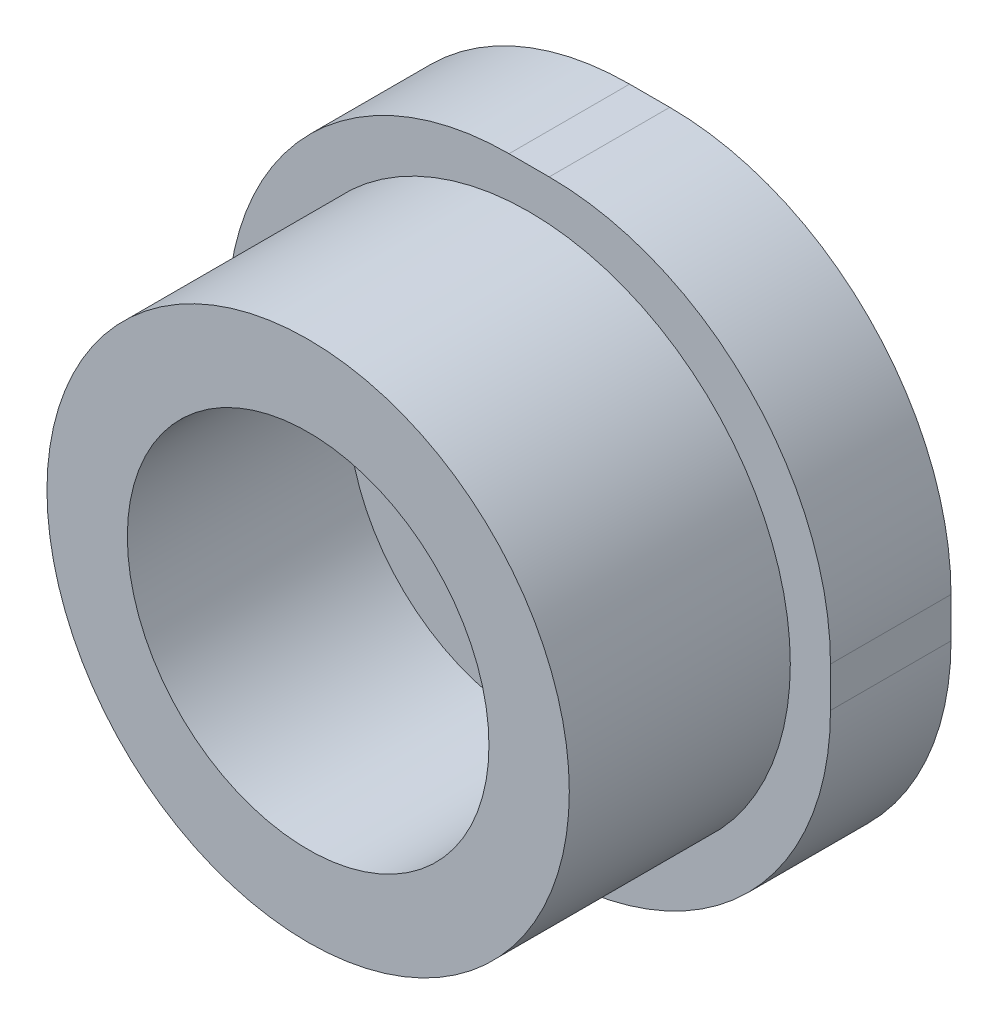
ISO-10303-21;
HEADER;
FILE_DESCRIPTION(('STEP AP214'),'2;1');
FILE_NAME('part.step','',(''),(''),'','','');
FILE_SCHEMA(('AUTOMOTIVE_DESIGN { 1 0 10303 214 1 1 1 1 }'));
ENDSEC;
DATA;
#1=APPLICATION_CONTEXT('core data for automotive mechanical design processes');
#2=APPLICATION_PROTOCOL_DEFINITION('international standard','automotive_design',2000,#1);
#3=PRODUCT_CONTEXT('',#1,'mechanical');
#4=PRODUCT('Part','Part','',(#3));
#5=PRODUCT_RELATED_PRODUCT_CATEGORY('part','',(#4));
#6=PRODUCT_DEFINITION_FORMATION('','',#4);
#7=PRODUCT_DEFINITION_CONTEXT('part definition',#1,'design');
#8=PRODUCT_DEFINITION('design','',#6,#7);
#9=PRODUCT_DEFINITION_SHAPE('','',#8);
#10=(LENGTH_UNIT() NAMED_UNIT(*) SI_UNIT(.MILLI.,.METRE.));
#11=(NAMED_UNIT(*) PLANE_ANGLE_UNIT() SI_UNIT($,.RADIAN.));
#12=(NAMED_UNIT(*) SI_UNIT($,.STERADIAN.) SOLID_ANGLE_UNIT());
#13=UNCERTAINTY_MEASURE_WITH_UNIT(LENGTH_MEASURE(1.E-05),#10,'distance_accuracy_value','');
#14=(GEOMETRIC_REPRESENTATION_CONTEXT(3) GLOBAL_UNCERTAINTY_ASSIGNED_CONTEXT((#13)) GLOBAL_UNIT_ASSIGNED_CONTEXT((#10,
#11,#12)) REPRESENTATION_CONTEXT('',''));
#15=CARTESIAN_POINT('',(0.,0.,0.));
#16=DIRECTION('',(0.,0.,1.));
#17=DIRECTION('',(1.,0.,0.));
#18=AXIS2_PLACEMENT_3D('',#15,#16,#17);
#19=CARTESIAN_POINT('',(0.,0.,55.));
#20=DIRECTION('',(0.,0.,1.));
#21=DIRECTION('',(1.,0.,0.));
#22=AXIS2_PLACEMENT_3D('',#19,#20,#21);
#23=PLANE('',#22);
#24=CARTESIAN_POINT('',(0.,0.,55.));
#25=DIRECTION('',(0.,0.,1.));
#26=DIRECTION('',(1.,0.,0.));
#27=AXIS2_PLACEMENT_3D('',#24,#25,#26);
#28=CIRCLE('',#27,65.);
#29=CARTESIAN_POINT('',(65.,0.,55.));
#30=VERTEX_POINT('',#29);
#31=EDGE_CURVE('E11',#30,#30,#28,.T.);
#32=ORIENTED_EDGE('',*,*,#31,.T.);
#33=EDGE_LOOP('',(#32));
#34=FACE_BOUND('',#33,.T.);
#35=CARTESIAN_POINT('',(0.,0.,55.));
#36=DIRECTION('',(0.,0.,1.));
#37=DIRECTION('',(1.,0.,0.));
#38=AXIS2_PLACEMENT_3D('',#35,#36,#37);
#39=CIRCLE('',#38,45.);
#40=CARTESIAN_POINT('',(45.,0.,55.));
#41=VERTEX_POINT('',#40);
#42=EDGE_CURVE('E54',#41,#41,#39,.T.);
#43=ORIENTED_EDGE('',*,*,#42,.F.);
#44=EDGE_LOOP('',(#43));
#45=FACE_BOUND('',#44,.T.);
#46=ADVANCED_FACE('F43',(#34,#45),#23,.T.);
#47=CARTESIAN_POINT('',(0.,0.,55.));
#48=DIRECTION('',(0.,0.,-1.));
#49=DIRECTION('',(-1.,0.,0.));
#50=AXIS2_PLACEMENT_3D('',#47,#48,#49);
#51=CYLINDRICAL_SURFACE('',#50,65.);
#52=ORIENTED_EDGE('',*,*,#31,.F.);
#53=EDGE_LOOP('',(#52));
#54=FACE_BOUND('',#53,.T.);
#55=CARTESIAN_POINT('',(0.,0.,0.));
#56=DIRECTION('',(0.,0.,1.));
#57=DIRECTION('',(1.,0.,0.));
#58=AXIS2_PLACEMENT_3D('',#55,#56,#57);
#59=CIRCLE('',#58,65.);
#60=CARTESIAN_POINT('',(65.,0.,0.));
#61=VERTEX_POINT('',#60);
#62=EDGE_CURVE('E47',#61,#61,#59,.T.);
#63=ORIENTED_EDGE('',*,*,#62,.T.);
#64=EDGE_LOOP('',(#63));
#65=FACE_BOUND('',#64,.T.);
#66=ADVANCED_FACE('F45',(#54,#65),#51,.T.);
#67=CARTESIAN_POINT('',(0.,0.,55.));
#68=DIRECTION('',(0.,0.,-1.));
#69=DIRECTION('',(-1.,0.,0.));
#70=AXIS2_PLACEMENT_3D('',#67,#68,#69);
#71=CYLINDRICAL_SURFACE('',#70,45.);
#72=ORIENTED_EDGE('',*,*,#42,.T.);
#73=EDGE_LOOP('',(#72));
#74=FACE_BOUND('',#73,.T.);
#75=CARTESIAN_POINT('',(0.,0.,0.));
#76=DIRECTION('',(0.,0.,1.));
#77=DIRECTION('',(1.,0.,0.));
#78=AXIS2_PLACEMENT_3D('',#75,#76,#77);
#79=CIRCLE('',#78,45.);
#80=CARTESIAN_POINT('',(45.,0.,0.));
#81=VERTEX_POINT('',#80);
#82=EDGE_CURVE('E194',#81,#81,#79,.T.);
#83=ORIENTED_EDGE('',*,*,#82,.F.);
#84=EDGE_LOOP('',(#83));
#85=FACE_BOUND('',#84,.T.);
#86=ADVANCED_FACE('F229',(#74,#85),#71,.F.);
#87=CARTESIAN_POINT('',(5.,-5.,0.));
#88=DIRECTION('',(0.,0.,1.));
#89=DIRECTION('',(1.,0.,0.));
#90=AXIS2_PLACEMENT_3D('',#87,#88,#89);
#91=PLANE('',#90);
#92=ORIENTED_EDGE('',*,*,#82,.T.);
#93=EDGE_LOOP('',(#92));
#94=FACE_BOUND('',#93,.T.);
#95=ADVANCED_FACE('F208',(#94),#91,.T.);
#96=CARTESIAN_POINT('',(5.,-5.,-30.));
#97=DIRECTION('',(0.,0.,1.));
#98=DIRECTION('',(1.,0.,0.));
#99=AXIS2_PLACEMENT_3D('',#96,#97,#98);
#100=CYLINDRICAL_SURFACE('',#99,70.);
#101=CARTESIAN_POINT('',(5.,-5.,0.));
#102=DIRECTION('',(0.,0.,-1.));
#103=DIRECTION('',(1.,0.,0.));
#104=AXIS2_PLACEMENT_3D('',#101,#102,#103);
#105=CIRCLE('',#104,70.);
#106=CARTESIAN_POINT('',(75.,-4.99999999999949,0.));
#107=VERTEX_POINT('',#106);
#108=CARTESIAN_POINT('',(4.99999999999949,-75.,0.));
#109=VERTEX_POINT('',#108);
#110=EDGE_CURVE('E147',#107,#109,#105,.T.);
#111=ORIENTED_EDGE('',*,*,#110,.T.);
#112=DIRECTION('',(0.,0.,1.));
#113=VECTOR('',#112,1.);
#114=CARTESIAN_POINT('',(4.99999999999949,-75.,-30.));
#115=LINE('',#114,#113);
#116=CARTESIAN_POINT('',(4.99999999999949,-75.,-30.));
#117=VERTEX_POINT('',#116);
#118=EDGE_CURVE('E188',#117,#109,#115,.T.);
#119=ORIENTED_EDGE('',*,*,#118,.F.);
#120=CARTESIAN_POINT('',(5.,-5.,-30.));
#121=DIRECTION('',(0.,0.,-1.));
#122=DIRECTION('',(1.,0.,0.));
#123=AXIS2_PLACEMENT_3D('',#120,#121,#122);
#124=CIRCLE('',#123,70.);
#125=CARTESIAN_POINT('',(75.,-4.99999999999949,-30.));
#126=VERTEX_POINT('',#125);
#127=EDGE_CURVE('E169',#126,#117,#124,.T.);
#128=ORIENTED_EDGE('',*,*,#127,.F.);
#129=DIRECTION('',(0.,0.,1.));
#130=VECTOR('',#129,1.);
#131=CARTESIAN_POINT('',(75.,-4.99999999999949,-30.));
#132=LINE('',#131,#130);
#133=EDGE_CURVE('E143',#126,#107,#132,.T.);
#134=ORIENTED_EDGE('',*,*,#133,.T.);
#135=EDGE_LOOP('',(#111,#119,#128,#134));
#136=FACE_BOUND('',#135,.T.);
#137=ADVANCED_FACE('F213',(#136),#100,.T.);
#138=CARTESIAN_POINT('',(4.99999999999949,-75.,-30.));
#139=DIRECTION('',(0.,1.,0.));
#140=DIRECTION('',(0.,0.,1.));
#141=AXIS2_PLACEMENT_3D('',#138,#139,#140);
#142=PLANE('',#141);
#143=DIRECTION('',(-1.,0.,0.));
#144=VECTOR('',#143,1.);
#145=CARTESIAN_POINT('',(4.99999999999949,-75.,0.));
#146=LINE('',#145,#144);
#147=CARTESIAN_POINT('',(-4.99999999999949,-75.,0.));
#148=VERTEX_POINT('',#147);
#149=EDGE_CURVE('E151',#109,#148,#146,.T.);
#150=ORIENTED_EDGE('',*,*,#149,.T.);
#151=DIRECTION('',(0.,0.,1.));
#152=VECTOR('',#151,1.);
#153=CARTESIAN_POINT('',(-4.99999999999949,-75.,-30.));
#154=LINE('',#153,#152);
#155=CARTESIAN_POINT('',(-4.99999999999949,-75.,-30.));
#156=VERTEX_POINT('',#155);
#157=EDGE_CURVE('E184',#156,#148,#154,.T.);
#158=ORIENTED_EDGE('',*,*,#157,.F.);
#159=DIRECTION('',(-1.,0.,0.));
#160=VECTOR('',#159,1.);
#161=CARTESIAN_POINT('',(4.99999999999949,-75.,-30.));
#162=LINE('',#161,#160);
#163=EDGE_CURVE('E106',#117,#156,#162,.T.);
#164=ORIENTED_EDGE('',*,*,#163,.F.);
#165=ORIENTED_EDGE('',*,*,#118,.T.);
#166=EDGE_LOOP('',(#150,#158,#164,#165));
#167=FACE_BOUND('',#166,.T.);
#168=ADVANCED_FACE('F238',(#167),#142,.F.);
#169=CARTESIAN_POINT('',(-5.,-5.,-30.));
#170=DIRECTION('',(0.,0.,1.));
#171=DIRECTION('',(1.,0.,0.));
#172=AXIS2_PLACEMENT_3D('',#169,#170,#171);
#173=CYLINDRICAL_SURFACE('',#172,70.);
#174=CARTESIAN_POINT('',(-5.,-5.,0.));
#175=DIRECTION('',(0.,0.,-1.));
#176=DIRECTION('',(-1.,0.,0.));
#177=AXIS2_PLACEMENT_3D('',#174,#175,#176);
#178=CIRCLE('',#177,70.);
#179=CARTESIAN_POINT('',(-75.,-5.,0.));
#180=VERTEX_POINT('',#179);
#181=EDGE_CURVE('E154',#148,#180,#178,.T.);
#182=ORIENTED_EDGE('',*,*,#181,.T.);
#183=DIRECTION('',(0.,0.,1.));
#184=VECTOR('',#183,1.);
#185=CARTESIAN_POINT('',(-75.,-5.,-30.));
#186=LINE('',#185,#184);
#187=CARTESIAN_POINT('',(-75.,-5.,-30.));
#188=VERTEX_POINT('',#187);
#189=EDGE_CURVE('E180',#188,#180,#186,.T.);
#190=ORIENTED_EDGE('',*,*,#189,.F.);
#191=CARTESIAN_POINT('',(-5.,-5.,-30.));
#192=DIRECTION('',(0.,0.,-1.));
#193=DIRECTION('',(-1.,0.,0.));
#194=AXIS2_PLACEMENT_3D('',#191,#192,#193);
#195=CIRCLE('',#194,70.);
#196=EDGE_CURVE('E370',#156,#188,#195,.T.);
#197=ORIENTED_EDGE('',*,*,#196,.F.);
#198=ORIENTED_EDGE('',*,*,#157,.T.);
#199=EDGE_LOOP('',(#182,#190,#197,#198));
#200=FACE_BOUND('',#199,.T.);
#201=ADVANCED_FACE('F241',(#200),#173,.T.);
#202=CARTESIAN_POINT('',(-75.,-4.99999999999949,-30.));
#203=DIRECTION('',(1.,0.,0.));
#204=DIRECTION('',(0.,0.,-1.));
#205=AXIS2_PLACEMENT_3D('',#202,#203,#204);
#206=PLANE('',#205);
#207=DIRECTION('',(0.,1.,0.));
#208=VECTOR('',#207,1.);
#209=CARTESIAN_POINT('',(-75.,-4.99999999999949,0.));
#210=LINE('',#209,#208);
#211=CARTESIAN_POINT('',(-75.,4.99999999999949,0.));
#212=VERTEX_POINT('',#211);
#213=EDGE_CURVE('E157',#180,#212,#210,.T.);
#214=ORIENTED_EDGE('',*,*,#213,.T.);
#215=DIRECTION('',(0.,0.,1.));
#216=VECTOR('',#215,1.);
#217=CARTESIAN_POINT('',(-75.,4.99999999999949,-30.));
#218=LINE('',#217,#216);
#219=CARTESIAN_POINT('',(-75.,4.99999999999949,-30.));
#220=VERTEX_POINT('',#219);
#221=EDGE_CURVE('E176',#220,#212,#218,.T.);
#222=ORIENTED_EDGE('',*,*,#221,.F.);
#223=DIRECTION('',(0.,1.,0.));
#224=VECTOR('',#223,1.);
#225=CARTESIAN_POINT('',(-75.,-4.99999999999949,-30.));
#226=LINE('',#225,#224);
#227=EDGE_CURVE('E368',#188,#220,#226,.T.);
#228=ORIENTED_EDGE('',*,*,#227,.F.);
#229=ORIENTED_EDGE('',*,*,#189,.T.);
#230=EDGE_LOOP('',(#214,#222,#228,#229));
#231=FACE_BOUND('',#230,.T.);
#232=ADVANCED_FACE('F244',(#231),#206,.F.);
#233=CARTESIAN_POINT('',(-5.,5.,-30.));
#234=DIRECTION('',(0.,0.,1.));
#235=DIRECTION('',(1.,0.,0.));
#236=AXIS2_PLACEMENT_3D('',#233,#234,#235);
#237=CYLINDRICAL_SURFACE('',#236,70.);
#238=CARTESIAN_POINT('',(-5.,5.,0.));
#239=DIRECTION('',(0.,0.,-1.));
#240=DIRECTION('',(1.,0.,0.));
#241=AXIS2_PLACEMENT_3D('',#238,#239,#240);
#242=CIRCLE('',#241,70.);
#243=CARTESIAN_POINT('',(-4.99999999999949,75.,0.));
#244=VERTEX_POINT('',#243);
#245=EDGE_CURVE('E160',#212,#244,#242,.T.);
#246=ORIENTED_EDGE('',*,*,#245,.T.);
#247=DIRECTION('',(0.,0.,1.));
#248=VECTOR('',#247,1.);
#249=CARTESIAN_POINT('',(-4.99999999999949,75.,-30.));
#250=LINE('',#249,#248);
#251=CARTESIAN_POINT('',(-4.99999999999949,75.,-30.));
#252=VERTEX_POINT('',#251);
#253=EDGE_CURVE('E136',#252,#244,#250,.T.);
#254=ORIENTED_EDGE('',*,*,#253,.F.);
#255=CARTESIAN_POINT('',(-5.,5.,-30.));
#256=DIRECTION('',(0.,0.,-1.));
#257=DIRECTION('',(1.,0.,0.));
#258=AXIS2_PLACEMENT_3D('',#255,#256,#257);
#259=CIRCLE('',#258,70.);
#260=EDGE_CURVE('E125',#220,#252,#259,.T.);
#261=ORIENTED_EDGE('',*,*,#260,.F.);
#262=ORIENTED_EDGE('',*,*,#221,.T.);
#263=EDGE_LOOP('',(#246,#254,#261,#262));
#264=FACE_BOUND('',#263,.T.);
#265=ADVANCED_FACE('F248',(#264),#237,.T.);
#266=CARTESIAN_POINT('',(4.99999999999949,75.,-30.));
#267=DIRECTION('',(0.,-1.,0.));
#268=DIRECTION('',(0.,0.,-1.));
#269=AXIS2_PLACEMENT_3D('',#266,#267,#268);
#270=PLANE('',#269);
#271=DIRECTION('',(1.,0.,0.));
#272=VECTOR('',#271,1.);
#273=CARTESIAN_POINT('',(4.99999999999949,75.,0.));
#274=LINE('',#273,#272);
#275=CARTESIAN_POINT('',(4.99999999999949,75.,0.));
#276=VERTEX_POINT('',#275);
#277=EDGE_CURVE('E134',#244,#276,#274,.T.);
#278=ORIENTED_EDGE('',*,*,#277,.T.);
#279=DIRECTION('',(0.,0.,1.));
#280=VECTOR('',#279,1.);
#281=CARTESIAN_POINT('',(4.99999999999949,75.,-30.));
#282=LINE('',#281,#280);
#283=CARTESIAN_POINT('',(4.99999999999949,75.,-30.));
#284=VERTEX_POINT('',#283);
#285=EDGE_CURVE('E131',#284,#276,#282,.T.);
#286=ORIENTED_EDGE('',*,*,#285,.F.);
#287=DIRECTION('',(1.,0.,0.));
#288=VECTOR('',#287,1.);
#289=CARTESIAN_POINT('',(4.99999999999949,75.,-30.));
#290=LINE('',#289,#288);
#291=EDGE_CURVE('E119',#252,#284,#290,.T.);
#292=ORIENTED_EDGE('',*,*,#291,.F.);
#293=ORIENTED_EDGE('',*,*,#253,.T.);
#294=EDGE_LOOP('',(#278,#286,#292,#293));
#295=FACE_BOUND('',#294,.T.);
#296=ADVANCED_FACE('F132',(#295),#270,.F.);
#297=CARTESIAN_POINT('',(5.,5.,-30.));
#298=DIRECTION('',(0.,0.,1.));
#299=DIRECTION('',(1.,0.,0.));
#300=AXIS2_PLACEMENT_3D('',#297,#298,#299);
#301=CYLINDRICAL_SURFACE('',#300,70.);
#302=CARTESIAN_POINT('',(5.,5.,0.));
#303=DIRECTION('',(0.,0.,-1.));
#304=DIRECTION('',(1.,0.,0.));
#305=AXIS2_PLACEMENT_3D('',#302,#303,#304);
#306=CIRCLE('',#305,70.);
#307=CARTESIAN_POINT('',(75.,4.99999999999951,0.));
#308=VERTEX_POINT('',#307);
#309=EDGE_CURVE('E91',#276,#308,#306,.T.);
#310=ORIENTED_EDGE('',*,*,#309,.T.);
#311=DIRECTION('',(0.,0.,1.));
#312=VECTOR('',#311,1.);
#313=CARTESIAN_POINT('',(75.,4.99999999999951,-30.));
#314=LINE('',#313,#312);
#315=CARTESIAN_POINT('',(75.,4.99999999999951,-30.));
#316=VERTEX_POINT('',#315);
#317=EDGE_CURVE('E137',#316,#308,#314,.T.);
#318=ORIENTED_EDGE('',*,*,#317,.F.);
#319=CARTESIAN_POINT('',(5.,5.,-30.));
#320=DIRECTION('',(0.,0.,-1.));
#321=DIRECTION('',(1.,0.,0.));
#322=AXIS2_PLACEMENT_3D('',#319,#320,#321);
#323=CIRCLE('',#322,70.);
#324=EDGE_CURVE('E123',#284,#316,#323,.T.);
#325=ORIENTED_EDGE('',*,*,#324,.F.);
#326=ORIENTED_EDGE('',*,*,#285,.T.);
#327=EDGE_LOOP('',(#310,#318,#325,#326));
#328=FACE_BOUND('',#327,.T.);
#329=ADVANCED_FACE('F139',(#328),#301,.T.);
#330=CARTESIAN_POINT('',(75.,-4.99999999999949,-30.));
#331=DIRECTION('',(-1.,0.,0.));
#332=DIRECTION('',(0.,0.,1.));
#333=AXIS2_PLACEMENT_3D('',#330,#331,#332);
#334=PLANE('',#333);
#335=DIRECTION('',(0.,-1.,0.));
#336=VECTOR('',#335,1.);
#337=CARTESIAN_POINT('',(75.,-4.99999999999949,0.));
#338=LINE('',#337,#336);
#339=EDGE_CURVE('E97',#308,#107,#338,.T.);
#340=ORIENTED_EDGE('',*,*,#339,.T.);
#341=ORIENTED_EDGE('',*,*,#133,.F.);
#342=DIRECTION('',(0.,-1.,0.));
#343=VECTOR('',#342,1.);
#344=CARTESIAN_POINT('',(75.,-4.99999999999949,-30.));
#345=LINE('',#344,#343);
#346=EDGE_CURVE('E62',#316,#126,#345,.T.);
#347=ORIENTED_EDGE('',*,*,#346,.F.);
#348=ORIENTED_EDGE('',*,*,#317,.T.);
#349=EDGE_LOOP('',(#340,#341,#347,#348));
#350=FACE_BOUND('',#349,.T.);
#351=ADVANCED_FACE('F215',(#350),#334,.F.);
#352=CARTESIAN_POINT('',(5.,-5.,-30.));
#353=DIRECTION('',(0.,0.,1.));
#354=DIRECTION('',(1.,0.,0.));
#355=AXIS2_PLACEMENT_3D('',#352,#353,#354);
#356=PLANE('',#355);
#357=ORIENTED_EDGE('',*,*,#127,.T.);
#358=ORIENTED_EDGE('',*,*,#163,.T.);
#359=ORIENTED_EDGE('',*,*,#196,.T.);
#360=ORIENTED_EDGE('',*,*,#227,.T.);
#361=ORIENTED_EDGE('',*,*,#260,.T.);
#362=ORIENTED_EDGE('',*,*,#291,.T.);
#363=ORIENTED_EDGE('',*,*,#324,.T.);
#364=ORIENTED_EDGE('',*,*,#346,.T.);
#365=EDGE_LOOP('',(#357,#358,#359,#360,#361,#362,#363,#364));
#366=FACE_BOUND('',#365,.T.);
#367=ADVANCED_FACE('F121',(#366),#356,.F.);
#368=ORIENTED_EDGE('',*,*,#62,.F.);
#369=EDGE_LOOP('',(#368));
#370=FACE_BOUND('',#369,.T.);
#371=ORIENTED_EDGE('',*,*,#110,.F.);
#372=ORIENTED_EDGE('',*,*,#339,.F.);
#373=ORIENTED_EDGE('',*,*,#309,.F.);
#374=ORIENTED_EDGE('',*,*,#277,.F.);
#375=ORIENTED_EDGE('',*,*,#245,.F.);
#376=ORIENTED_EDGE('',*,*,#213,.F.);
#377=ORIENTED_EDGE('',*,*,#181,.F.);
#378=ORIENTED_EDGE('',*,*,#149,.F.);
#379=EDGE_LOOP('',(#371,#372,#373,#374,#375,#376,#377,#378));
#380=FACE_BOUND('',#379,.T.);
#381=ADVANCED_FACE('F204',(#370,#380),#91,.T.);
#382=CLOSED_SHELL('',(#46,#66,#86,#95,#137,#168,#201,#232,#265,#296,#329,#351,#367,#381));
#383=MANIFOLD_SOLID_BREP('B2',#382);
#384=ADVANCED_BREP_SHAPE_REPRESENTATION('',(#18,#383),#14);
#385=SHAPE_DEFINITION_REPRESENTATION(#9,#384);
ENDSEC;
END-ISO-10303-21;
